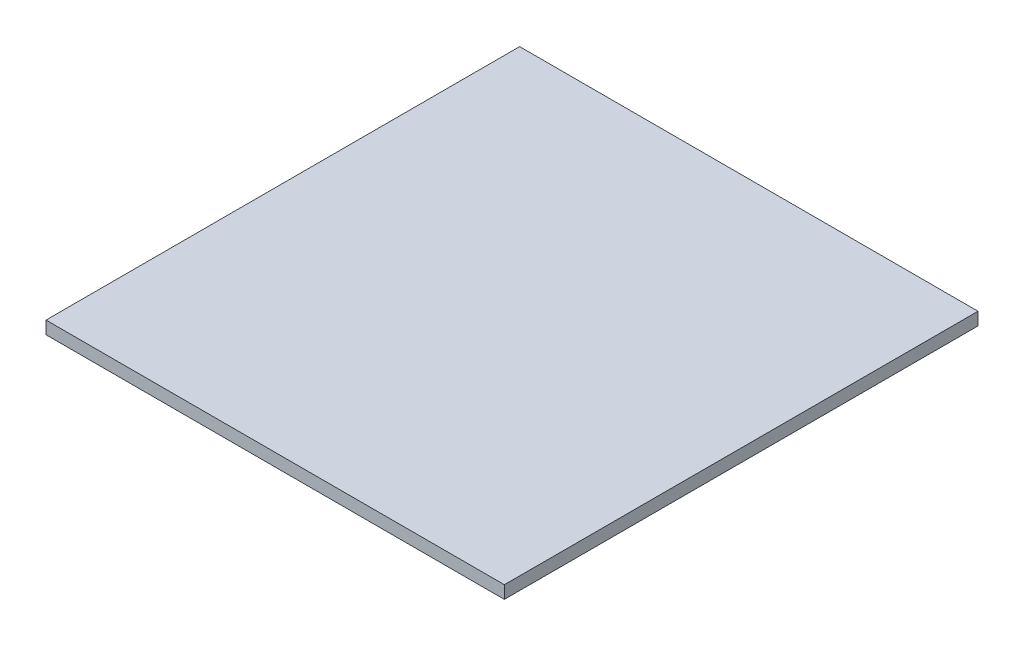
ISO-10303-21;
HEADER;
FILE_DESCRIPTION(('STEP AP214'),'2;1');
FILE_NAME('part.step','',(''),(''),'','','');
FILE_SCHEMA(('AUTOMOTIVE_DESIGN { 1 0 10303 214 1 1 1 1 }'));
ENDSEC;
DATA;
#1=APPLICATION_CONTEXT('core data for automotive mechanical design processes');
#2=APPLICATION_PROTOCOL_DEFINITION('international standard','automotive_design',2000,#1);
#3=PRODUCT_CONTEXT('',#1,'mechanical');
#4=PRODUCT('Part','Part','',(#3));
#5=PRODUCT_RELATED_PRODUCT_CATEGORY('part','',(#4));
#6=PRODUCT_DEFINITION_FORMATION('','',#4);
#7=PRODUCT_DEFINITION_CONTEXT('part definition',#1,'design');
#8=PRODUCT_DEFINITION('design','',#6,#7);
#9=PRODUCT_DEFINITION_SHAPE('','',#8);
#10=(LENGTH_UNIT() NAMED_UNIT(*) SI_UNIT(.MILLI.,.METRE.));
#11=(NAMED_UNIT(*) PLANE_ANGLE_UNIT() SI_UNIT($,.RADIAN.));
#12=(NAMED_UNIT(*) SI_UNIT($,.STERADIAN.) SOLID_ANGLE_UNIT());
#13=UNCERTAINTY_MEASURE_WITH_UNIT(LENGTH_MEASURE(1.E-05),#10,'distance_accuracy_value','');
#14=(GEOMETRIC_REPRESENTATION_CONTEXT(3) GLOBAL_UNCERTAINTY_ASSIGNED_CONTEXT((#13)) GLOBAL_UNIT_ASSIGNED_CONTEXT((#10,
#11,#12)) REPRESENTATION_CONTEXT('',''));
#15=CARTESIAN_POINT('',(0.,0.,0.));
#16=DIRECTION('',(0.,0.,1.));
#17=DIRECTION('',(1.,0.,0.));
#18=AXIS2_PLACEMENT_3D('',#15,#16,#17);
#19=CARTESIAN_POINT('',(0.,15.875,0.));
#20=DIRECTION('',(1.,0.,0.));
#21=DIRECTION('',(0.,0.,-1.));
#22=AXIS2_PLACEMENT_3D('',#19,#20,#21);
#23=PLANE('',#22);
#24=DIRECTION('',(0.,0.,1.));
#25=VECTOR('',#24,1.);
#26=CARTESIAN_POINT('',(0.,0.,0.));
#27=LINE('',#26,#25);
#28=CARTESIAN_POINT('',(0.,0.,-590.55));
#29=VERTEX_POINT('',#28);
#30=CARTESIAN_POINT('',(0.,0.,0.));
#31=VERTEX_POINT('',#30);
#32=EDGE_CURVE('E94',#29,#31,#27,.T.);
#33=ORIENTED_EDGE('',*,*,#32,.T.);
#34=DIRECTION('',(0.,-1.,0.));
#35=VECTOR('',#34,1.);
#36=CARTESIAN_POINT('',(0.,15.875,0.));
#37=LINE('',#36,#35);
#38=CARTESIAN_POINT('',(0.,15.875,0.));
#39=VERTEX_POINT('',#38);
#40=EDGE_CURVE('E11',#39,#31,#37,.T.);
#41=ORIENTED_EDGE('',*,*,#40,.F.);
#42=DIRECTION('',(0.,0.,1.));
#43=VECTOR('',#42,1.);
#44=CARTESIAN_POINT('',(0.,15.875,0.));
#45=LINE('',#44,#43);
#46=CARTESIAN_POINT('',(0.,15.875,-590.55));
#47=VERTEX_POINT('',#46);
#48=EDGE_CURVE('E82',#47,#39,#45,.T.);
#49=ORIENTED_EDGE('',*,*,#48,.F.);
#50=DIRECTION('',(0.,-1.,0.));
#51=VECTOR('',#50,1.);
#52=CARTESIAN_POINT('',(0.,15.875,-590.55));
#53=LINE('',#52,#51);
#54=EDGE_CURVE('E90',#47,#29,#53,.T.);
#55=ORIENTED_EDGE('',*,*,#54,.T.);
#56=EDGE_LOOP('',(#33,#41,#49,#55));
#57=FACE_BOUND('',#56,.T.);
#58=ADVANCED_FACE('F31',(#57),#23,.F.);
#59=CARTESIAN_POINT('',(0.,15.875,0.));
#60=DIRECTION('',(0.,0.,-1.));
#61=DIRECTION('',(-1.,0.,0.));
#62=AXIS2_PLACEMENT_3D('',#59,#60,#61);
#63=PLANE('',#62);
#64=DIRECTION('',(1.,0.,0.));
#65=VECTOR('',#64,1.);
#66=CARTESIAN_POINT('',(0.,0.,0.));
#67=LINE('',#66,#65);
#68=CARTESIAN_POINT('',(571.5,0.,0.));
#69=VERTEX_POINT('',#68);
#70=EDGE_CURVE('E86',#31,#69,#67,.T.);
#71=ORIENTED_EDGE('',*,*,#70,.T.);
#72=DIRECTION('',(0.,-1.,0.));
#73=VECTOR('',#72,1.);
#74=CARTESIAN_POINT('',(571.5,15.875,0.));
#75=LINE('',#74,#73);
#76=CARTESIAN_POINT('',(571.5,15.875,0.));
#77=VERTEX_POINT('',#76);
#78=EDGE_CURVE('E39',#77,#69,#75,.T.);
#79=ORIENTED_EDGE('',*,*,#78,.F.);
#80=DIRECTION('',(1.,0.,0.));
#81=VECTOR('',#80,1.);
#82=CARTESIAN_POINT('',(0.,15.875,0.));
#83=LINE('',#82,#81);
#84=EDGE_CURVE('E77',#39,#77,#83,.T.);
#85=ORIENTED_EDGE('',*,*,#84,.F.);
#86=ORIENTED_EDGE('',*,*,#40,.T.);
#87=EDGE_LOOP('',(#71,#79,#85,#86));
#88=FACE_BOUND('',#87,.T.);
#89=ADVANCED_FACE('F85',(#88),#63,.F.);
#90=CARTESIAN_POINT('',(571.5,15.875,0.));
#91=DIRECTION('',(-1.,0.,0.));
#92=DIRECTION('',(0.,0.,1.));
#93=AXIS2_PLACEMENT_3D('',#90,#91,#92);
#94=PLANE('',#93);
#95=DIRECTION('',(0.,0.,-1.));
#96=VECTOR('',#95,1.);
#97=CARTESIAN_POINT('',(571.5,0.,0.));
#98=LINE('',#97,#96);
#99=CARTESIAN_POINT('',(571.5,0.,-590.55));
#100=VERTEX_POINT('',#99);
#101=EDGE_CURVE('E64',#69,#100,#98,.T.);
#102=ORIENTED_EDGE('',*,*,#101,.T.);
#103=DIRECTION('',(0.,-1.,0.));
#104=VECTOR('',#103,1.);
#105=CARTESIAN_POINT('',(571.5,15.875,-590.55));
#106=LINE('',#105,#104);
#107=CARTESIAN_POINT('',(571.5,15.875,-590.55));
#108=VERTEX_POINT('',#107);
#109=EDGE_CURVE('E87',#108,#100,#106,.T.);
#110=ORIENTED_EDGE('',*,*,#109,.F.);
#111=DIRECTION('',(0.,0.,-1.));
#112=VECTOR('',#111,1.);
#113=CARTESIAN_POINT('',(571.5,15.875,0.));
#114=LINE('',#113,#112);
#115=EDGE_CURVE('E80',#77,#108,#114,.T.);
#116=ORIENTED_EDGE('',*,*,#115,.F.);
#117=ORIENTED_EDGE('',*,*,#78,.T.);
#118=EDGE_LOOP('',(#102,#110,#116,#117));
#119=FACE_BOUND('',#118,.T.);
#120=ADVANCED_FACE('F88',(#119),#94,.F.);
#121=CARTESIAN_POINT('',(0.,15.875,-590.55));
#122=DIRECTION('',(0.,0.,1.));
#123=DIRECTION('',(1.,0.,0.));
#124=AXIS2_PLACEMENT_3D('',#121,#122,#123);
#125=PLANE('',#124);
#126=DIRECTION('',(-1.,0.,0.));
#127=VECTOR('',#126,1.);
#128=CARTESIAN_POINT('',(0.,0.,-590.55));
#129=LINE('',#128,#127);
#130=EDGE_CURVE('E70',#100,#29,#129,.T.);
#131=ORIENTED_EDGE('',*,*,#130,.T.);
#132=ORIENTED_EDGE('',*,*,#54,.F.);
#133=DIRECTION('',(-1.,0.,0.));
#134=VECTOR('',#133,1.);
#135=CARTESIAN_POINT('',(0.,15.875,-590.55));
#136=LINE('',#135,#134);
#137=EDGE_CURVE('E47',#108,#47,#136,.T.);
#138=ORIENTED_EDGE('',*,*,#137,.F.);
#139=ORIENTED_EDGE('',*,*,#109,.T.);
#140=EDGE_LOOP('',(#131,#132,#138,#139));
#141=FACE_BOUND('',#140,.T.);
#142=ADVANCED_FACE('F101',(#141),#125,.F.);
#143=CARTESIAN_POINT('',(0.,15.875,-590.55));
#144=DIRECTION('',(0.,-1.,0.));
#145=DIRECTION('',(0.,0.,-1.));
#146=AXIS2_PLACEMENT_3D('',#143,#144,#145);
#147=PLANE('',#146);
#148=ORIENTED_EDGE('',*,*,#48,.T.);
#149=ORIENTED_EDGE('',*,*,#84,.T.);
#150=ORIENTED_EDGE('',*,*,#115,.T.);
#151=ORIENTED_EDGE('',*,*,#137,.T.);
#152=EDGE_LOOP('',(#148,#149,#150,#151));
#153=FACE_BOUND('',#152,.T.);
#154=ADVANCED_FACE('F78',(#153),#147,.F.);
#155=CARTESIAN_POINT('',(0.,0.,-590.55));
#156=DIRECTION('',(0.,-1.,0.));
#157=DIRECTION('',(0.,0.,-1.));
#158=AXIS2_PLACEMENT_3D('',#155,#156,#157);
#159=PLANE('',#158);
#160=ORIENTED_EDGE('',*,*,#32,.F.);
#161=ORIENTED_EDGE('',*,*,#130,.F.);
#162=ORIENTED_EDGE('',*,*,#101,.F.);
#163=ORIENTED_EDGE('',*,*,#70,.F.);
#164=EDGE_LOOP('',(#160,#161,#162,#163));
#165=FACE_BOUND('',#164,.T.);
#166=ADVANCED_FACE('F104',(#165),#159,.T.);
#167=CLOSED_SHELL('',(#58,#89,#120,#142,#154,#166));
#168=MANIFOLD_SOLID_BREP('B2',#167);
#169=ADVANCED_BREP_SHAPE_REPRESENTATION('',(#18,#168),#14);
#170=SHAPE_DEFINITION_REPRESENTATION(#9,#169);
ENDSEC;
END-ISO-10303-21;
